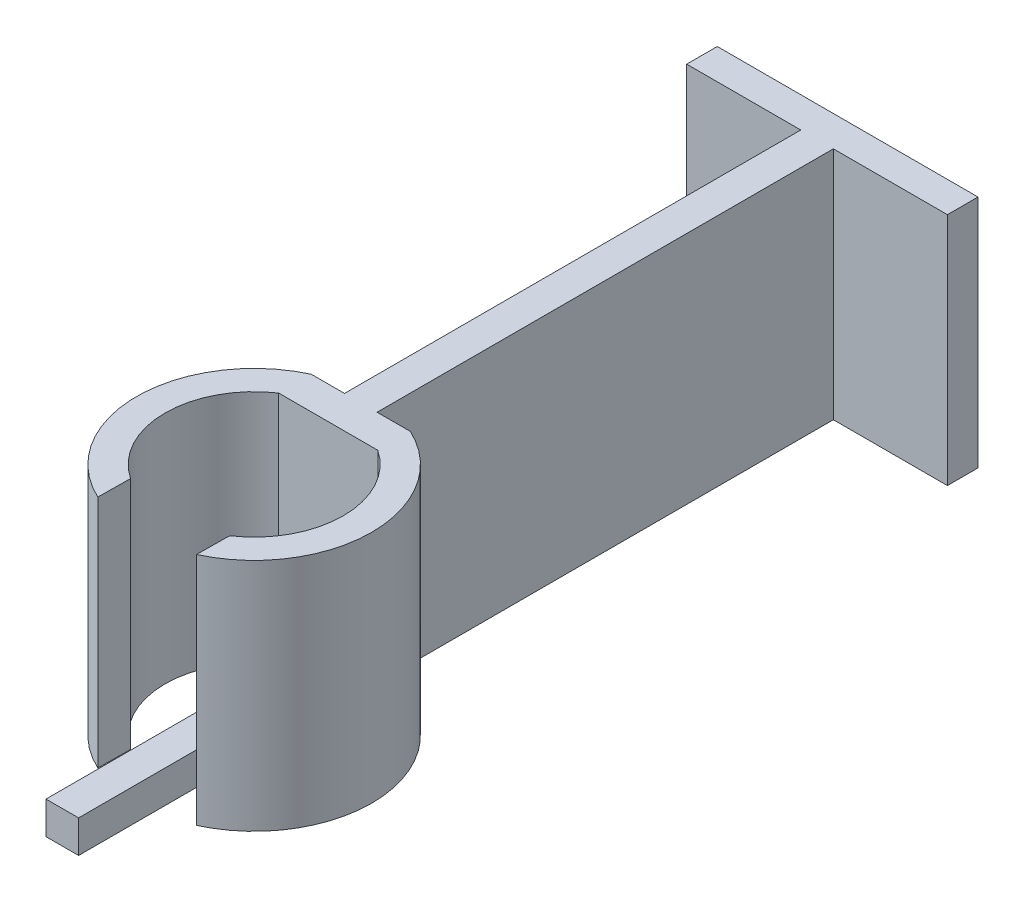
ISO-10303-21;
HEADER;
FILE_DESCRIPTION(('STEP AP214'),'2;1');
FILE_NAME('part.step','',(''),(''),'','','');
FILE_SCHEMA(('AUTOMOTIVE_DESIGN { 1 0 10303 214 1 1 1 1 }'));
ENDSEC;
DATA;
#1=APPLICATION_CONTEXT('core data for automotive mechanical design processes');
#2=APPLICATION_PROTOCOL_DEFINITION('international standard','automotive_design',2000,#1);
#3=PRODUCT_CONTEXT('',#1,'mechanical');
#4=PRODUCT('Part','Part','',(#3));
#5=PRODUCT_RELATED_PRODUCT_CATEGORY('part','',(#4));
#6=PRODUCT_DEFINITION_FORMATION('','',#4);
#7=PRODUCT_DEFINITION_CONTEXT('part definition',#1,'design');
#8=PRODUCT_DEFINITION('design','',#6,#7);
#9=PRODUCT_DEFINITION_SHAPE('','',#8);
#10=(LENGTH_UNIT() NAMED_UNIT(*) SI_UNIT(.MILLI.,.METRE.));
#11=(NAMED_UNIT(*) PLANE_ANGLE_UNIT() SI_UNIT($,.RADIAN.));
#12=(NAMED_UNIT(*) SI_UNIT($,.STERADIAN.) SOLID_ANGLE_UNIT());
#13=UNCERTAINTY_MEASURE_WITH_UNIT(LENGTH_MEASURE(1.E-05),#10,'distance_accuracy_value','');
#14=(GEOMETRIC_REPRESENTATION_CONTEXT(3) GLOBAL_UNCERTAINTY_ASSIGNED_CONTEXT((#13)) GLOBAL_UNIT_ASSIGNED_CONTEXT((#10,
#11,#12)) REPRESENTATION_CONTEXT('',''));
#15=CARTESIAN_POINT('',(0.,0.,0.));
#16=DIRECTION('',(0.,0.,1.));
#17=DIRECTION('',(1.,0.,0.));
#18=AXIS2_PLACEMENT_3D('',#15,#16,#17);
#19=CARTESIAN_POINT('',(3.2385,3.175,-26.3995273159458));
#20=DIRECTION('',(-1.,0.,0.));
#21=DIRECTION('',(0.,-1.,0.));
#22=AXIS2_PLACEMENT_3D('',#19,#20,#21);
#23=PLANE('',#22);
#24=DIRECTION('',(0.,0.,1.));
#25=VECTOR('',#24,1.);
#26=CARTESIAN_POINT('',(3.2385,0.,-26.3995273159458));
#27=LINE('',#26,#25);
#28=CARTESIAN_POINT('',(3.2385,0.,-26.3995273159458));
#29=VERTEX_POINT('',#28);
#30=CARTESIAN_POINT('',(3.2385,0.,0.508));
#31=VERTEX_POINT('',#30);
#32=EDGE_CURVE('E48',#29,#31,#27,.T.);
#33=ORIENTED_EDGE('',*,*,#32,.T.);
#34=DIRECTION('',(0.,-1.,0.));
#35=VECTOR('',#34,1.);
#36=CARTESIAN_POINT('',(3.2385,3.175,0.508));
#37=LINE('',#36,#35);
#38=CARTESIAN_POINT('',(3.2385,3.175,0.508));
#39=VERTEX_POINT('',#38);
#40=EDGE_CURVE('E85',#39,#31,#37,.T.);
#41=ORIENTED_EDGE('',*,*,#40,.F.);
#42=DIRECTION('',(0.,0.,1.));
#43=VECTOR('',#42,1.);
#44=CARTESIAN_POINT('',(3.2385,3.175,-26.3995273159458));
#45=LINE('',#44,#43);
#46=CARTESIAN_POINT('',(3.2385,3.175,-26.3995273159458));
#47=VERTEX_POINT('',#46);
#48=EDGE_CURVE('E12',#47,#39,#45,.T.);
#49=ORIENTED_EDGE('',*,*,#48,.F.);
#50=DIRECTION('',(0.,-1.,0.));
#51=VECTOR('',#50,1.);
#52=CARTESIAN_POINT('',(3.2385,3.175,-26.3995273159458));
#53=LINE('',#52,#51);
#54=EDGE_CURVE('E86',#47,#29,#53,.T.);
#55=ORIENTED_EDGE('',*,*,#54,.T.);
#56=EDGE_LOOP('',(#33,#41,#49,#55));
#57=FACE_BOUND('',#56,.T.);
#58=ADVANCED_FACE('F45',(#57),#23,.T.);
#59=CARTESIAN_POINT('',(3.2385,3.175,-26.3995273159458));
#60=DIRECTION('',(0.,1.,0.));
#61=DIRECTION('',(0.,0.,1.));
#62=AXIS2_PLACEMENT_3D('',#59,#60,#61);
#63=PLANE('',#62);
#64=ORIENTED_EDGE('',*,*,#48,.T.);
#65=DIRECTION('',(-1.,0.,0.));
#66=VECTOR('',#65,1.);
#67=CARTESIAN_POINT('',(3.2385,3.175,0.508));
#68=LINE('',#67,#66);
#69=CARTESIAN_POINT('',(6.4135,3.175,0.508));
#70=VERTEX_POINT('',#69);
#71=EDGE_CURVE('E102',#70,#39,#68,.T.);
#72=ORIENTED_EDGE('',*,*,#71,.F.);
#73=DIRECTION('',(0.,0.,1.));
#74=VECTOR('',#73,1.);
#75=CARTESIAN_POINT('',(6.4135,3.175,-26.3995273159458));
#76=LINE('',#75,#74);
#77=CARTESIAN_POINT('',(6.4135,3.175,-26.3995273159458));
#78=VERTEX_POINT('',#77);
#79=EDGE_CURVE('E53',#78,#70,#76,.T.);
#80=ORIENTED_EDGE('',*,*,#79,.F.);
#81=DIRECTION('',(-1.,0.,0.));
#82=VECTOR('',#81,1.);
#83=CARTESIAN_POINT('',(3.2385,3.175,-26.3995273159458));
#84=LINE('',#83,#82);
#85=EDGE_CURVE('E91',#78,#47,#84,.T.);
#86=ORIENTED_EDGE('',*,*,#85,.T.);
#87=EDGE_LOOP('',(#64,#72,#80,#86));
#88=FACE_BOUND('',#87,.T.);
#89=ADVANCED_FACE('F117',(#88),#63,.T.);
#90=CARTESIAN_POINT('',(6.4135,3.175,-26.3995273159458));
#91=DIRECTION('',(1.,0.,0.));
#92=DIRECTION('',(0.,0.,-1.));
#93=AXIS2_PLACEMENT_3D('',#90,#91,#92);
#94=PLANE('',#93);
#95=ORIENTED_EDGE('',*,*,#79,.T.);
#96=DIRECTION('',(0.,1.,0.));
#97=VECTOR('',#96,1.);
#98=CARTESIAN_POINT('',(6.4135,3.175,0.508));
#99=LINE('',#98,#97);
#100=CARTESIAN_POINT('',(6.4135,0.,0.508));
#101=VERTEX_POINT('',#100);
#102=EDGE_CURVE('E98',#101,#70,#99,.T.);
#103=ORIENTED_EDGE('',*,*,#102,.F.);
#104=DIRECTION('',(0.,0.,1.));
#105=VECTOR('',#104,1.);
#106=CARTESIAN_POINT('',(6.4135,0.,-26.3995273159458));
#107=LINE('',#106,#105);
#108=CARTESIAN_POINT('',(6.4135,0.,-26.3995273159458));
#109=VERTEX_POINT('',#108);
#110=EDGE_CURVE('E90',#109,#101,#107,.T.);
#111=ORIENTED_EDGE('',*,*,#110,.F.);
#112=DIRECTION('',(0.,1.,0.));
#113=VECTOR('',#112,1.);
#114=CARTESIAN_POINT('',(6.4135,3.175,-26.3995273159458));
#115=LINE('',#114,#113);
#116=EDGE_CURVE('E110',#109,#78,#115,.T.);
#117=ORIENTED_EDGE('',*,*,#116,.T.);
#118=EDGE_LOOP('',(#95,#103,#111,#117));
#119=FACE_BOUND('',#118,.T.);
#120=ADVANCED_FACE('F114',(#119),#94,.T.);
#121=CARTESIAN_POINT('',(3.2385,0.,-26.3995273159458));
#122=DIRECTION('',(0.,-1.,0.));
#123=DIRECTION('',(0.,0.,-1.));
#124=AXIS2_PLACEMENT_3D('',#121,#122,#123);
#125=PLANE('',#124);
#126=ORIENTED_EDGE('',*,*,#110,.T.);
#127=DIRECTION('',(1.,0.,0.));
#128=VECTOR('',#127,1.);
#129=CARTESIAN_POINT('',(3.2385,0.,0.508));
#130=LINE('',#129,#128);
#131=EDGE_CURVE('E93',#31,#101,#130,.T.);
#132=ORIENTED_EDGE('',*,*,#131,.F.);
#133=ORIENTED_EDGE('',*,*,#32,.F.);
#134=DIRECTION('',(1.,0.,0.));
#135=VECTOR('',#134,1.);
#136=CARTESIAN_POINT('',(3.2385,0.,-26.3995273159458));
#137=LINE('',#136,#135);
#138=EDGE_CURVE('E108',#29,#109,#137,.T.);
#139=ORIENTED_EDGE('',*,*,#138,.T.);
#140=EDGE_LOOP('',(#126,#132,#133,#139));
#141=FACE_BOUND('',#140,.T.);
#142=ADVANCED_FACE('F94',(#141),#125,.T.);
#143=CARTESIAN_POINT('',(0.,0.,-26.3995273159458));
#144=DIRECTION('',(0.,0.,1.));
#145=DIRECTION('',(1.,0.,0.));
#146=AXIS2_PLACEMENT_3D('',#143,#144,#145);
#147=PLANE('',#146);
#148=ORIENTED_EDGE('',*,*,#54,.F.);
#149=ORIENTED_EDGE('',*,*,#85,.F.);
#150=ORIENTED_EDGE('',*,*,#116,.F.);
#151=ORIENTED_EDGE('',*,*,#138,.F.);
#152=EDGE_LOOP('',(#148,#149,#150,#151));
#153=FACE_BOUND('',#152,.T.);
#154=ADVANCED_FACE('F119',(#153),#147,.F.);
#155=CARTESIAN_POINT('',(0.,0.,0.508));
#156=DIRECTION('',(0.,0.,1.));
#157=DIRECTION('',(1.,0.,0.));
#158=AXIS2_PLACEMENT_3D('',#155,#156,#157);
#159=PLANE('',#158);
#160=ORIENTED_EDGE('',*,*,#40,.T.);
#161=ORIENTED_EDGE('',*,*,#131,.T.);
#162=ORIENTED_EDGE('',*,*,#102,.T.);
#163=ORIENTED_EDGE('',*,*,#71,.T.);
#164=EDGE_LOOP('',(#160,#161,#162,#163));
#165=FACE_BOUND('',#164,.T.);
#166=ADVANCED_FACE('F101',(#165),#159,.T.);
#167=CLOSED_SHELL('',(#58,#89,#120,#142,#154,#166));
#168=MANIFOLD_SOLID_BREP('B2',#167);
#169=CARTESIAN_POINT('',(-0.118010079242921,22.86,-0.00126994000359893));
#170=DIRECTION('',(0.999942102409549,0.,0.010760661167922));
#171=DIRECTION('',(0.010760661167922,0.,-0.999942102409549));
#172=AXIS2_PLACEMENT_3D('',#169,#170,#171);
#173=PLANE('',#172);
#174=DIRECTION('',(-0.010760661167922,0.,0.999942102409549));
#175=VECTOR('',#174,1.);
#176=CARTESIAN_POINT('',(-0.118010079242921,0.,-0.00126994000359893));
#177=LINE('',#176,#175);
#178=CARTESIAN_POINT('',(0.,0.,-10.9674405964552));
#179=VERTEX_POINT('',#178);
#180=CARTESIAN_POINT('',(-0.0339964399700141,0.,-7.80829720112228));
#181=VERTEX_POINT('',#180);
#182=EDGE_CURVE('E307',#179,#181,#177,.T.);
#183=ORIENTED_EDGE('',*,*,#182,.F.);
#184=DIRECTION('',(0.,-1.,0.));
#185=VECTOR('',#184,1.);
#186=CARTESIAN_POINT('',(0.,22.86,-10.9674405964552));
#187=LINE('',#186,#185);
#188=CARTESIAN_POINT('',(0.,22.86,-10.9674405964552));
#189=VERTEX_POINT('',#188);
#190=EDGE_CURVE('E311',#189,#179,#187,.T.);
#191=ORIENTED_EDGE('',*,*,#190,.F.);
#192=DIRECTION('',(-0.010760661167922,0.,0.999942102409549));
#193=VECTOR('',#192,1.);
#194=CARTESIAN_POINT('',(-0.118010079242921,22.86,-0.00126994000359893));
#195=LINE('',#194,#193);
#196=CARTESIAN_POINT('',(-0.0339964399700141,22.86,-7.80829720112228));
#197=VERTEX_POINT('',#196);
#198=EDGE_CURVE('E314',#189,#197,#195,.T.);
#199=ORIENTED_EDGE('',*,*,#198,.T.);
#200=DIRECTION('',(0.,-1.,0.));
#201=VECTOR('',#200,1.);
#202=CARTESIAN_POINT('',(-0.0339964399700141,22.86,-7.80829720112228));
#203=LINE('',#202,#201);
#204=EDGE_CURVE('E313',#197,#181,#203,.T.);
#205=ORIENTED_EDGE('',*,*,#204,.T.);
#206=EDGE_LOOP('',(#183,#191,#199,#205));
#207=FACE_BOUND('',#206,.T.);
#208=ADVANCED_FACE('F168',(#207),#173,.T.);
#209=CARTESIAN_POINT('',(9.53546414072687,22.86,0.100401102351105));
#210=DIRECTION('',(0.999944572258483,0.,0.0105286471495349));
#211=DIRECTION('',(0.0105286471495349,0.,-0.999944572258483));
#212=AXIS2_PLACEMENT_3D('',#209,#210,#211);
#213=PLANE('',#212);
#214=DIRECTION('',(-0.0105286471495349,0.,0.999944572258483));
#215=VECTOR('',#214,1.);
#216=CARTESIAN_POINT('',(9.53546414072687,0.,0.100401102351105));
#217=LINE('',#216,#215);
#218=CARTESIAN_POINT('',(9.652,0.,-10.9674405964552));
#219=VERTEX_POINT('',#218);
#220=CARTESIAN_POINT('',(9.61840610996845,0.,-7.77690457402047));
#221=VERTEX_POINT('',#220);
#222=EDGE_CURVE('E293',#219,#221,#217,.T.);
#223=ORIENTED_EDGE('',*,*,#222,.T.);
#224=DIRECTION('',(0.,-1.,0.));
#225=VECTOR('',#224,1.);
#226=CARTESIAN_POINT('',(9.61840610996845,22.86,-7.77690457402047));
#227=LINE('',#226,#225);
#228=CARTESIAN_POINT('',(9.61840610996845,22.86,-7.77690457402047));
#229=VERTEX_POINT('',#228);
#230=EDGE_CURVE('E319',#229,#221,#227,.T.);
#231=ORIENTED_EDGE('',*,*,#230,.F.);
#232=DIRECTION('',(-0.0105286471495349,0.,0.999944572258483));
#233=VECTOR('',#232,1.);
#234=CARTESIAN_POINT('',(9.53546414072687,22.86,0.100401102351105));
#235=LINE('',#234,#233);
#236=CARTESIAN_POINT('',(9.652,22.86,-10.9674405964552));
#237=VERTEX_POINT('',#236);
#238=EDGE_CURVE('E382',#237,#229,#235,.T.);
#239=ORIENTED_EDGE('',*,*,#238,.F.);
#240=DIRECTION('',(0.,-1.,0.));
#241=VECTOR('',#240,1.);
#242=CARTESIAN_POINT('',(9.652,22.86,-10.9674405964552));
#243=LINE('',#242,#241);
#244=EDGE_CURVE('E321',#237,#219,#243,.T.);
#245=ORIENTED_EDGE('',*,*,#244,.T.);
#246=EDGE_LOOP('',(#223,#231,#239,#245));
#247=FACE_BOUND('',#246,.T.);
#248=ADVANCED_FACE('F367',(#247),#213,.F.);
#249=CARTESIAN_POINT('',(4.826,22.86,-18.1837202982276));
#250=DIRECTION('',(0.,-1.,0.));
#251=DIRECTION('',(0.,0.,-1.));
#252=AXIS2_PLACEMENT_3D('',#249,#250,#251);
#253=CYLINDRICAL_SURFACE('',#252,8.68129994495136);
#254=CARTESIAN_POINT('',(4.826,0.,-18.1837202982276));
#255=DIRECTION('',(0.,1.,0.));
#256=DIRECTION('',(0.,0.,1.));
#257=AXIS2_PLACEMENT_3D('',#254,#255,#256);
#258=CIRCLE('',#257,8.68129994495136);
#259=CARTESIAN_POINT('',(9.652,0.,-25.4));
#260=VERTEX_POINT('',#259);
#261=EDGE_CURVE('E358',#219,#260,#258,.T.);
#262=ORIENTED_EDGE('',*,*,#261,.F.);
#263=ORIENTED_EDGE('',*,*,#244,.F.);
#264=CARTESIAN_POINT('',(4.826,22.86,-18.1837202982276));
#265=DIRECTION('',(0.,1.,0.));
#266=DIRECTION('',(0.,0.,1.));
#267=AXIS2_PLACEMENT_3D('',#264,#265,#266);
#268=CIRCLE('',#267,8.68129994495136);
#269=CARTESIAN_POINT('',(9.652,22.86,-25.4));
#270=VERTEX_POINT('',#269);
#271=EDGE_CURVE('E384',#237,#270,#268,.T.);
#272=ORIENTED_EDGE('',*,*,#271,.T.);
#273=DIRECTION('',(0.,-1.,0.));
#274=VECTOR('',#273,1.);
#275=CARTESIAN_POINT('',(9.652,22.86,-25.4));
#276=LINE('',#275,#274);
#277=EDGE_CURVE('E323',#270,#260,#276,.T.);
#278=ORIENTED_EDGE('',*,*,#277,.T.);
#279=EDGE_LOOP('',(#262,#263,#272,#278));
#280=FACE_BOUND('',#279,.T.);
#281=ADVANCED_FACE('F429',(#280),#253,.F.);
#282=CARTESIAN_POINT('',(0.,22.86,-25.4));
#283=DIRECTION('',(0.,0.,-1.));
#284=DIRECTION('',(-1.,0.,0.));
#285=AXIS2_PLACEMENT_3D('',#282,#283,#284);
#286=PLANE('',#285);
#287=DIRECTION('',(1.,0.,0.));
#288=VECTOR('',#287,1.);
#289=CARTESIAN_POINT('',(0.,0.,-25.4));
#290=LINE('',#289,#288);
#291=CARTESIAN_POINT('',(0.,0.,-25.4));
#292=VERTEX_POINT('',#291);
#293=EDGE_CURVE('E240',#292,#260,#290,.T.);
#294=ORIENTED_EDGE('',*,*,#293,.T.);
#295=ORIENTED_EDGE('',*,*,#277,.F.);
#296=DIRECTION('',(1.,0.,0.));
#297=VECTOR('',#296,1.);
#298=CARTESIAN_POINT('',(0.,22.86,-25.4));
#299=LINE('',#298,#297);
#300=CARTESIAN_POINT('',(0.,22.86,-25.4));
#301=VERTEX_POINT('',#300);
#302=EDGE_CURVE('E413',#301,#270,#299,.T.);
#303=ORIENTED_EDGE('',*,*,#302,.F.);
#304=DIRECTION('',(0.,-1.,0.));
#305=VECTOR('',#304,1.);
#306=CARTESIAN_POINT('',(0.,22.86,-25.4));
#307=LINE('',#306,#305);
#308=EDGE_CURVE('E324',#301,#292,#307,.T.);
#309=ORIENTED_EDGE('',*,*,#308,.T.);
#310=EDGE_LOOP('',(#294,#295,#303,#309));
#311=FACE_BOUND('',#310,.T.);
#312=ADVANCED_FACE('F414',(#311),#286,.F.);
#313=CARTESIAN_POINT('',(4.826,22.86,-18.1837202982276));
#314=DIRECTION('',(0.,-1.,0.));
#315=DIRECTION('',(0.,0.,-1.));
#316=AXIS2_PLACEMENT_3D('',#313,#314,#315);
#317=CYLINDRICAL_SURFACE('',#316,8.68129994495136);
#318=CARTESIAN_POINT('',(4.826,0.,-18.1837202982276));
#319=DIRECTION('',(0.,1.,0.));
#320=DIRECTION('',(0.,0.,1.));
#321=AXIS2_PLACEMENT_3D('',#318,#319,#320);
#322=CIRCLE('',#321,8.68129994495136);
#323=EDGE_CURVE('E353',#179,#292,#322,.F.);
#324=ORIENTED_EDGE('',*,*,#323,.T.);
#325=ORIENTED_EDGE('',*,*,#308,.F.);
#326=CARTESIAN_POINT('',(4.826,22.86,-18.1837202982276));
#327=DIRECTION('',(0.,1.,0.));
#328=DIRECTION('',(0.,0.,1.));
#329=AXIS2_PLACEMENT_3D('',#326,#327,#328);
#330=CIRCLE('',#329,8.68129994495136);
#331=EDGE_CURVE('E310',#189,#301,#330,.F.);
#332=ORIENTED_EDGE('',*,*,#331,.F.);
#333=ORIENTED_EDGE('',*,*,#190,.T.);
#334=EDGE_LOOP('',(#324,#325,#332,#333));
#335=FACE_BOUND('',#334,.T.);
#336=ADVANCED_FACE('F420',(#335),#317,.F.);
#337=CARTESIAN_POINT('',(4.826,22.86,-18.1837202982276));
#338=DIRECTION('',(0.,-1.,0.));
#339=DIRECTION('',(0.,0.,-1.));
#340=AXIS2_PLACEMENT_3D('',#337,#338,#339);
#341=CYLINDRICAL_SURFACE('',#340,11.4572671191898);
#342=CARTESIAN_POINT('',(4.826,0.,-18.1837202982276));
#343=DIRECTION('',(0.,1.,0.));
#344=DIRECTION('',(0.,0.,1.));
#345=AXIS2_PLACEMENT_3D('',#342,#343,#344);
#346=CIRCLE('',#345,11.4572671191898);
#347=CARTESIAN_POINT('',(9.65199999999999,0.,-28.575));
#348=VERTEX_POINT('',#347);
#349=EDGE_CURVE('E288',#348,#221,#346,.F.);
#350=ORIENTED_EDGE('',*,*,#349,.F.);
#351=DIRECTION('',(0.,-1.,0.));
#352=VECTOR('',#351,1.);
#353=CARTESIAN_POINT('',(9.65199999999999,22.86,-28.575));
#354=LINE('',#353,#352);
#355=CARTESIAN_POINT('',(9.65199999999999,22.86,-28.575));
#356=VERTEX_POINT('',#355);
#357=EDGE_CURVE('E285',#356,#348,#354,.T.);
#358=ORIENTED_EDGE('',*,*,#357,.F.);
#359=CARTESIAN_POINT('',(4.826,22.86,-18.1837202982276));
#360=DIRECTION('',(0.,1.,0.));
#361=DIRECTION('',(0.,0.,1.));
#362=AXIS2_PLACEMENT_3D('',#359,#360,#361);
#363=CIRCLE('',#362,11.4572671191898);
#364=EDGE_CURVE('E377',#356,#229,#363,.F.);
#365=ORIENTED_EDGE('',*,*,#364,.T.);
#366=ORIENTED_EDGE('',*,*,#230,.T.);
#367=EDGE_LOOP('',(#350,#358,#365,#366));
#368=FACE_BOUND('',#367,.T.);
#369=ADVANCED_FACE('F374',(#368),#341,.T.);
#370=CARTESIAN_POINT('',(4.826,22.86,-18.1837202982276));
#371=DIRECTION('',(0.,-1.,0.));
#372=DIRECTION('',(0.,0.,-1.));
#373=AXIS2_PLACEMENT_3D('',#370,#371,#372);
#374=CYLINDRICAL_SURFACE('',#373,11.4572671191898);
#375=CARTESIAN_POINT('',(4.826,0.,-18.1837202982276));
#376=DIRECTION('',(0.,1.,0.));
#377=DIRECTION('',(0.,0.,1.));
#378=AXIS2_PLACEMENT_3D('',#375,#376,#377);
#379=CIRCLE('',#378,11.4572671191898);
#380=CARTESIAN_POINT('',(0.,0.,-28.575));
#381=VERTEX_POINT('',#380);
#382=EDGE_CURVE('E291',#381,#181,#379,.T.);
#383=ORIENTED_EDGE('',*,*,#382,.T.);
#384=ORIENTED_EDGE('',*,*,#204,.F.);
#385=CARTESIAN_POINT('',(4.826,22.86,-18.1837202982276));
#386=DIRECTION('',(0.,1.,0.));
#387=DIRECTION('',(0.,0.,1.));
#388=AXIS2_PLACEMENT_3D('',#385,#386,#387);
#389=CIRCLE('',#388,11.4572671191898);
#390=CARTESIAN_POINT('',(0.,22.86,-28.575));
#391=VERTEX_POINT('',#390);
#392=EDGE_CURVE('E388',#391,#197,#389,.T.);
#393=ORIENTED_EDGE('',*,*,#392,.F.);
#394=DIRECTION('',(0.,-1.,0.));
#395=VECTOR('',#394,1.);
#396=CARTESIAN_POINT('',(0.,22.86,-28.575));
#397=LINE('',#396,#395);
#398=EDGE_CURVE('E316',#391,#381,#397,.T.);
#399=ORIENTED_EDGE('',*,*,#398,.T.);
#400=EDGE_LOOP('',(#383,#384,#393,#399));
#401=FACE_BOUND('',#400,.T.);
#402=ADVANCED_FACE('F427',(#401),#374,.T.);
#403=CARTESIAN_POINT('',(0.,0.,0.));
#404=DIRECTION('',(0.,1.,0.));
#405=DIRECTION('',(0.,0.,1.));
#406=AXIS2_PLACEMENT_3D('',#403,#404,#405);
#407=PLANE('',#406);
#408=ORIENTED_EDGE('',*,*,#323,.F.);
#409=ORIENTED_EDGE('',*,*,#182,.T.);
#410=ORIENTED_EDGE('',*,*,#382,.F.);
#411=DIRECTION('',(1.,0.,0.));
#412=VECTOR('',#411,1.);
#413=CARTESIAN_POINT('',(0.,0.,-28.575));
#414=LINE('',#413,#412);
#415=CARTESIAN_POINT('',(3.2385,0.,-28.575));
#416=VERTEX_POINT('',#415);
#417=EDGE_CURVE('E287',#381,#416,#414,.T.);
#418=ORIENTED_EDGE('',*,*,#417,.T.);
#419=DIRECTION('',(0.,0.,1.));
#420=VECTOR('',#419,1.);
#421=CARTESIAN_POINT('',(3.23849999999999,0.,-73.025));
#422=LINE('',#421,#420);
#423=CARTESIAN_POINT('',(3.23849999999999,0.,-73.025));
#424=VERTEX_POINT('',#423);
#425=EDGE_CURVE('E281',#424,#416,#422,.T.);
#426=ORIENTED_EDGE('',*,*,#425,.F.);
#427=DIRECTION('',(-1.,0.,0.));
#428=VECTOR('',#427,1.);
#429=CARTESIAN_POINT('',(0.,0.,-73.025));
#430=LINE('',#429,#428);
#431=CARTESIAN_POINT('',(-7.874,0.,-73.025));
#432=VERTEX_POINT('',#431);
#433=EDGE_CURVE('E585',#424,#432,#430,.T.);
#434=ORIENTED_EDGE('',*,*,#433,.T.);
#435=DIRECTION('',(0.,0.,-1.));
#436=VECTOR('',#435,1.);
#437=CARTESIAN_POINT('',(-7.874,0.,0.));
#438=LINE('',#437,#436);
#439=CARTESIAN_POINT('',(-7.874,0.,-76.0046341544019));
#440=VERTEX_POINT('',#439);
#441=EDGE_CURVE('E581',#432,#440,#438,.T.);
#442=ORIENTED_EDGE('',*,*,#441,.T.);
#443=DIRECTION('',(-1.,0.,0.));
#444=VECTOR('',#443,1.);
#445=CARTESIAN_POINT('',(0.,0.,-76.0046341544019));
#446=LINE('',#445,#444);
#447=CARTESIAN_POINT('',(17.526,0.,-76.0046341544019));
#448=VERTEX_POINT('',#447);
#449=EDGE_CURVE('E609',#448,#440,#446,.T.);
#450=ORIENTED_EDGE('',*,*,#449,.F.);
#451=DIRECTION('',(0.,0.,-1.));
#452=VECTOR('',#451,1.);
#453=CARTESIAN_POINT('',(17.526,0.,0.));
#454=LINE('',#453,#452);
#455=CARTESIAN_POINT('',(17.526,0.,-73.025));
#456=VERTEX_POINT('',#455);
#457=EDGE_CURVE('E596',#456,#448,#454,.T.);
#458=ORIENTED_EDGE('',*,*,#457,.F.);
#459=CARTESIAN_POINT('',(6.41349999999999,0.,-73.025));
#460=VERTEX_POINT('',#459);
#461=EDGE_CURVE('E280',#456,#460,#430,.T.);
#462=ORIENTED_EDGE('',*,*,#461,.T.);
#463=DIRECTION('',(0.,0.,1.));
#464=VECTOR('',#463,1.);
#465=CARTESIAN_POINT('',(6.41349999999999,0.,-73.025));
#466=LINE('',#465,#464);
#467=CARTESIAN_POINT('',(6.4135,0.,-28.575));
#468=VERTEX_POINT('',#467);
#469=EDGE_CURVE('E270',#460,#468,#466,.T.);
#470=ORIENTED_EDGE('',*,*,#469,.T.);
#471=EDGE_CURVE('E276',#468,#348,#414,.T.);
#472=ORIENTED_EDGE('',*,*,#471,.T.);
#473=ORIENTED_EDGE('',*,*,#349,.T.);
#474=ORIENTED_EDGE('',*,*,#222,.F.);
#475=ORIENTED_EDGE('',*,*,#261,.T.);
#476=ORIENTED_EDGE('',*,*,#293,.F.);
#477=EDGE_LOOP('',(#408,#409,#410,#418,#426,#434,#442,#450,#458,#462,#470,#472,#473,#474,#475,#476));
#478=FACE_BOUND('',#477,.T.);
#479=ADVANCED_FACE('F274',(#478),#407,.F.);
#480=CARTESIAN_POINT('',(0.,22.86,0.));
#481=DIRECTION('',(0.,1.,0.));
#482=DIRECTION('',(0.,0.,1.));
#483=AXIS2_PLACEMENT_3D('',#480,#481,#482);
#484=PLANE('',#483);
#485=ORIENTED_EDGE('',*,*,#331,.T.);
#486=ORIENTED_EDGE('',*,*,#302,.T.);
#487=ORIENTED_EDGE('',*,*,#271,.F.);
#488=ORIENTED_EDGE('',*,*,#238,.T.);
#489=ORIENTED_EDGE('',*,*,#364,.F.);
#490=DIRECTION('',(1.,0.,0.));
#491=VECTOR('',#490,1.);
#492=CARTESIAN_POINT('',(0.,22.86,-28.575));
#493=LINE('',#492,#491);
#494=CARTESIAN_POINT('',(6.4135,22.86,-28.575));
#495=VERTEX_POINT('',#494);
#496=EDGE_CURVE('E335',#495,#356,#493,.T.);
#497=ORIENTED_EDGE('',*,*,#496,.F.);
#498=DIRECTION('',(0.,0.,1.));
#499=VECTOR('',#498,1.);
#500=CARTESIAN_POINT('',(6.41349999999999,22.86,-73.025));
#501=LINE('',#500,#499);
#502=CARTESIAN_POINT('',(6.41349999999999,22.86,-73.025));
#503=VERTEX_POINT('',#502);
#504=EDGE_CURVE('E272',#503,#495,#501,.T.);
#505=ORIENTED_EDGE('',*,*,#504,.F.);
#506=DIRECTION('',(-1.,0.,0.));
#507=VECTOR('',#506,1.);
#508=CARTESIAN_POINT('',(0.,22.86,-73.025));
#509=LINE('',#508,#507);
#510=CARTESIAN_POINT('',(17.526,22.86,-73.025));
#511=VERTEX_POINT('',#510);
#512=EDGE_CURVE('E619',#511,#503,#509,.T.);
#513=ORIENTED_EDGE('',*,*,#512,.F.);
#514=DIRECTION('',(0.,0.,-1.));
#515=VECTOR('',#514,1.);
#516=CARTESIAN_POINT('',(17.526,22.86,0.));
#517=LINE('',#516,#515);
#518=CARTESIAN_POINT('',(17.526,22.86,-76.0046341544019));
#519=VERTEX_POINT('',#518);
#520=EDGE_CURVE('E618',#511,#519,#517,.T.);
#521=ORIENTED_EDGE('',*,*,#520,.T.);
#522=DIRECTION('',(-1.,0.,0.));
#523=VECTOR('',#522,1.);
#524=CARTESIAN_POINT('',(0.,22.86,-76.0046341544019));
#525=LINE('',#524,#523);
#526=CARTESIAN_POINT('',(-7.874,22.86,-76.0046341544019));
#527=VERTEX_POINT('',#526);
#528=EDGE_CURVE('E592',#519,#527,#525,.T.);
#529=ORIENTED_EDGE('',*,*,#528,.T.);
#530=DIRECTION('',(0.,0.,-1.));
#531=VECTOR('',#530,1.);
#532=CARTESIAN_POINT('',(-7.874,22.86,0.));
#533=LINE('',#532,#531);
#534=CARTESIAN_POINT('',(-7.874,22.86,-73.025));
#535=VERTEX_POINT('',#534);
#536=EDGE_CURVE('E611',#535,#527,#533,.T.);
#537=ORIENTED_EDGE('',*,*,#536,.F.);
#538=CARTESIAN_POINT('',(3.23849999999999,22.86,-73.025));
#539=VERTEX_POINT('',#538);
#540=EDGE_CURVE('E350',#539,#535,#509,.T.);
#541=ORIENTED_EDGE('',*,*,#540,.F.);
#542=DIRECTION('',(0.,0.,1.));
#543=VECTOR('',#542,1.);
#544=CARTESIAN_POINT('',(3.23849999999999,22.86,-73.025));
#545=LINE('',#544,#543);
#546=CARTESIAN_POINT('',(3.2385,22.86,-28.575));
#547=VERTEX_POINT('',#546);
#548=EDGE_CURVE('E404',#539,#547,#545,.T.);
#549=ORIENTED_EDGE('',*,*,#548,.T.);
#550=EDGE_CURVE('E298',#391,#547,#493,.T.);
#551=ORIENTED_EDGE('',*,*,#550,.F.);
#552=ORIENTED_EDGE('',*,*,#392,.T.);
#553=ORIENTED_EDGE('',*,*,#198,.F.);
#554=EDGE_LOOP('',(#485,#486,#487,#488,#489,#497,#505,#513,#521,#529,#537,#541,#549,#551,#552,#553));
#555=FACE_BOUND('',#554,.T.);
#556=ADVANCED_FACE('F402',(#555),#484,.T.);
#557=CARTESIAN_POINT('',(0.,22.86,-28.575));
#558=DIRECTION('',(0.,0.,-1.));
#559=DIRECTION('',(-1.,0.,0.));
#560=AXIS2_PLACEMENT_3D('',#557,#558,#559);
#561=PLANE('',#560);
#562=ORIENTED_EDGE('',*,*,#550,.T.);
#563=DIRECTION('',(0.,-1.,0.));
#564=VECTOR('',#563,1.);
#565=CARTESIAN_POINT('',(3.2385,22.86,-28.575));
#566=LINE('',#565,#564);
#567=EDGE_CURVE('E178',#547,#416,#566,.T.);
#568=ORIENTED_EDGE('',*,*,#567,.T.);
#569=ORIENTED_EDGE('',*,*,#417,.F.);
#570=ORIENTED_EDGE('',*,*,#398,.F.);
#571=EDGE_LOOP('',(#562,#568,#569,#570));
#572=FACE_BOUND('',#571,.T.);
#573=ADVANCED_FACE('F398',(#572),#561,.T.);
#574=DIRECTION('',(0.,-1.,0.));
#575=VECTOR('',#574,1.);
#576=CARTESIAN_POINT('',(6.4135,22.86,-28.575));
#577=LINE('',#576,#575);
#578=EDGE_CURVE('E43',#495,#468,#577,.T.);
#579=ORIENTED_EDGE('',*,*,#578,.F.);
#580=ORIENTED_EDGE('',*,*,#496,.T.);
#581=ORIENTED_EDGE('',*,*,#357,.T.);
#582=ORIENTED_EDGE('',*,*,#471,.F.);
#583=EDGE_LOOP('',(#579,#580,#581,#582));
#584=FACE_BOUND('',#583,.T.);
#585=ADVANCED_FACE('F283',(#584),#561,.T.);
#586=CARTESIAN_POINT('',(0.,22.86,-76.0046341544019));
#587=DIRECTION('',(0.,0.,1.));
#588=DIRECTION('',(1.,0.,0.));
#589=AXIS2_PLACEMENT_3D('',#586,#587,#588);
#590=PLANE('',#589);
#591=ORIENTED_EDGE('',*,*,#449,.T.);
#592=DIRECTION('',(0.,-1.,0.));
#593=VECTOR('',#592,1.);
#594=CARTESIAN_POINT('',(-7.874,22.86,-76.0046341544019));
#595=LINE('',#594,#593);
#596=EDGE_CURVE('E608',#527,#440,#595,.T.);
#597=ORIENTED_EDGE('',*,*,#596,.F.);
#598=ORIENTED_EDGE('',*,*,#528,.F.);
#599=DIRECTION('',(0.,-1.,0.));
#600=VECTOR('',#599,1.);
#601=CARTESIAN_POINT('',(17.526,22.86,-76.0046341544019));
#602=LINE('',#601,#600);
#603=EDGE_CURVE('E605',#519,#448,#602,.T.);
#604=ORIENTED_EDGE('',*,*,#603,.T.);
#605=EDGE_LOOP('',(#591,#597,#598,#604));
#606=FACE_BOUND('',#605,.T.);
#607=ADVANCED_FACE('F447',(#606),#590,.F.);
#608=CARTESIAN_POINT('',(17.526,22.86,0.));
#609=DIRECTION('',(-1.,0.,0.));
#610=DIRECTION('',(0.,0.,1.));
#611=AXIS2_PLACEMENT_3D('',#608,#609,#610);
#612=PLANE('',#611);
#613=ORIENTED_EDGE('',*,*,#457,.T.);
#614=ORIENTED_EDGE('',*,*,#603,.F.);
#615=ORIENTED_EDGE('',*,*,#520,.F.);
#616=DIRECTION('',(0.,-1.,0.));
#617=VECTOR('',#616,1.);
#618=CARTESIAN_POINT('',(17.526,22.86,-73.025));
#619=LINE('',#618,#617);
#620=EDGE_CURVE('E603',#511,#456,#619,.T.);
#621=ORIENTED_EDGE('',*,*,#620,.T.);
#622=EDGE_LOOP('',(#613,#614,#615,#621));
#623=FACE_BOUND('',#622,.T.);
#624=ADVANCED_FACE('F517',(#623),#612,.F.);
#625=CARTESIAN_POINT('',(-7.874,22.86,0.));
#626=DIRECTION('',(-1.,0.,0.));
#627=DIRECTION('',(0.,0.,1.));
#628=AXIS2_PLACEMENT_3D('',#625,#626,#627);
#629=PLANE('',#628);
#630=ORIENTED_EDGE('',*,*,#441,.F.);
#631=DIRECTION('',(0.,-1.,0.));
#632=VECTOR('',#631,1.);
#633=CARTESIAN_POINT('',(-7.874,22.86,-73.025));
#634=LINE('',#633,#632);
#635=EDGE_CURVE('E349',#535,#432,#634,.T.);
#636=ORIENTED_EDGE('',*,*,#635,.F.);
#637=ORIENTED_EDGE('',*,*,#536,.T.);
#638=ORIENTED_EDGE('',*,*,#596,.T.);
#639=EDGE_LOOP('',(#630,#636,#637,#638));
#640=FACE_BOUND('',#639,.T.);
#641=ADVANCED_FACE('F519',(#640),#629,.T.);
#642=CARTESIAN_POINT('',(0.,22.86,-73.025));
#643=DIRECTION('',(0.,0.,1.));
#644=DIRECTION('',(1.,0.,0.));
#645=AXIS2_PLACEMENT_3D('',#642,#643,#644);
#646=PLANE('',#645);
#647=ORIENTED_EDGE('',*,*,#512,.T.);
#648=DIRECTION('',(0.,-1.,0.));
#649=VECTOR('',#648,1.);
#650=CARTESIAN_POINT('',(6.41349999999999,22.86,-73.025));
#651=LINE('',#650,#649);
#652=EDGE_CURVE('E225',#503,#460,#651,.T.);
#653=ORIENTED_EDGE('',*,*,#652,.T.);
#654=ORIENTED_EDGE('',*,*,#461,.F.);
#655=ORIENTED_EDGE('',*,*,#620,.F.);
#656=EDGE_LOOP('',(#647,#653,#654,#655));
#657=FACE_BOUND('',#656,.T.);
#658=ADVANCED_FACE('F529',(#657),#646,.T.);
#659=DIRECTION('',(0.,-1.,0.));
#660=VECTOR('',#659,1.);
#661=CARTESIAN_POINT('',(3.23849999999999,22.86,-73.025));
#662=LINE('',#661,#660);
#663=EDGE_CURVE('E231',#539,#424,#662,.T.);
#664=ORIENTED_EDGE('',*,*,#663,.F.);
#665=ORIENTED_EDGE('',*,*,#540,.T.);
#666=ORIENTED_EDGE('',*,*,#635,.T.);
#667=ORIENTED_EDGE('',*,*,#433,.F.);
#668=EDGE_LOOP('',(#664,#665,#666,#667));
#669=FACE_BOUND('',#668,.T.);
#670=ADVANCED_FACE('F547',(#669),#646,.T.);
#671=CARTESIAN_POINT('',(3.23849999999999,22.86,-73.025));
#672=DIRECTION('',(1.,0.,0.));
#673=DIRECTION('',(0.,0.,-1.));
#674=AXIS2_PLACEMENT_3D('',#671,#672,#673);
#675=PLANE('',#674);
#676=ORIENTED_EDGE('',*,*,#425,.T.);
#677=ORIENTED_EDGE('',*,*,#567,.F.);
#678=ORIENTED_EDGE('',*,*,#548,.F.);
#679=ORIENTED_EDGE('',*,*,#663,.T.);
#680=EDGE_LOOP('',(#676,#677,#678,#679));
#681=FACE_BOUND('',#680,.T.);
#682=ADVANCED_FACE('F558',(#681),#675,.F.);
#683=CARTESIAN_POINT('',(6.41349999999999,22.86,-73.025));
#684=DIRECTION('',(1.,0.,0.));
#685=DIRECTION('',(0.,0.,-1.));
#686=AXIS2_PLACEMENT_3D('',#683,#684,#685);
#687=PLANE('',#686);
#688=ORIENTED_EDGE('',*,*,#469,.F.);
#689=ORIENTED_EDGE('',*,*,#652,.F.);
#690=ORIENTED_EDGE('',*,*,#504,.T.);
#691=ORIENTED_EDGE('',*,*,#578,.T.);
#692=EDGE_LOOP('',(#688,#689,#690,#691));
#693=FACE_BOUND('',#692,.T.);
#694=ADVANCED_FACE('F170',(#693),#687,.T.);
#695=CLOSED_SHELL('',(#208,#248,#281,#312,#336,#369,#402,#479,#556,#573,#585,#607,#624,#641,
#658,#670,#682,#694));
#696=MANIFOLD_SOLID_BREP('B6',#695);
#697=ADVANCED_BREP_SHAPE_REPRESENTATION('',(#18,#168,#696),#14);
#698=SHAPE_DEFINITION_REPRESENTATION(#9,#697);
ENDSEC;
END-ISO-10303-21;
